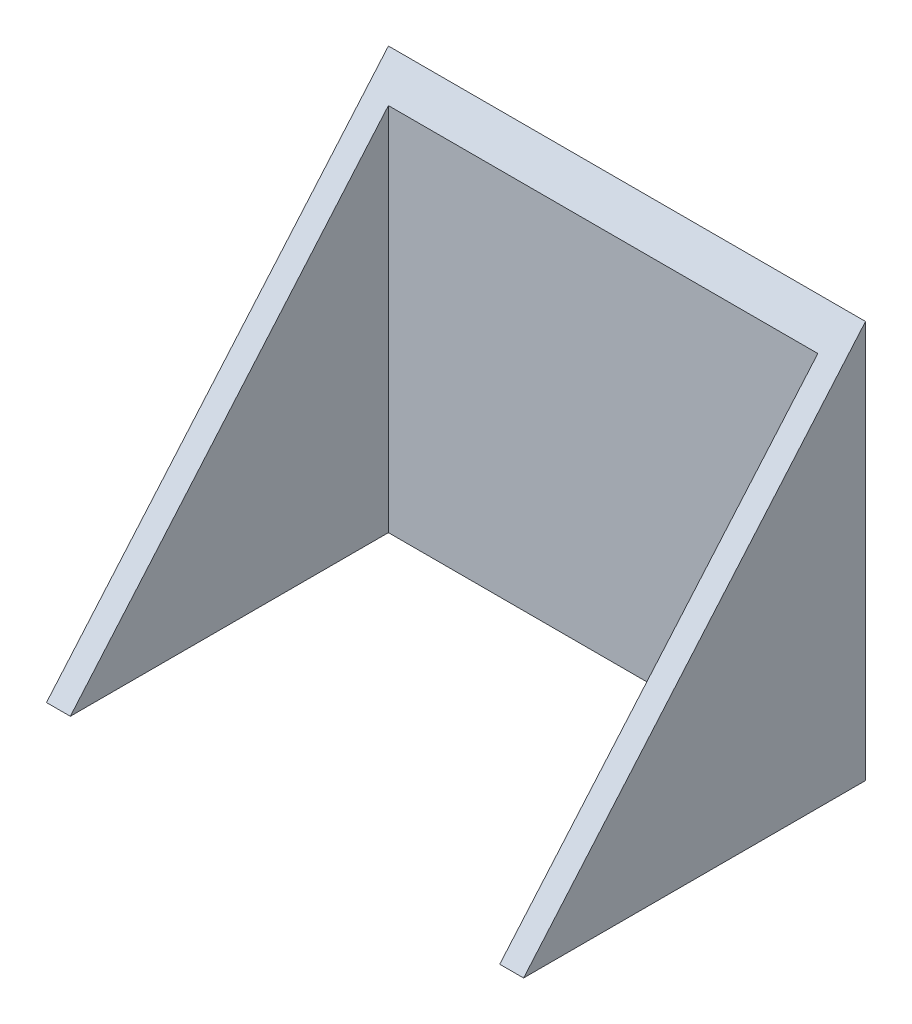
ISO-10303-21;
HEADER;
FILE_DESCRIPTION(('STEP AP214'),'2;1');
FILE_NAME('part.step','',(''),(''),'','','');
FILE_SCHEMA(('AUTOMOTIVE_DESIGN { 1 0 10303 214 1 1 1 1 }'));
ENDSEC;
DATA;
#1=APPLICATION_CONTEXT('core data for automotive mechanical design processes');
#2=APPLICATION_PROTOCOL_DEFINITION('international standard','automotive_design',2000,#1);
#3=PRODUCT_CONTEXT('',#1,'mechanical');
#4=PRODUCT('Part','Part','',(#3));
#5=PRODUCT_RELATED_PRODUCT_CATEGORY('part','',(#4));
#6=PRODUCT_DEFINITION_FORMATION('','',#4);
#7=PRODUCT_DEFINITION_CONTEXT('part definition',#1,'design');
#8=PRODUCT_DEFINITION('design','',#6,#7);
#9=PRODUCT_DEFINITION_SHAPE('','',#8);
#10=(LENGTH_UNIT() NAMED_UNIT(*) SI_UNIT(.MILLI.,.METRE.));
#11=(NAMED_UNIT(*) PLANE_ANGLE_UNIT() SI_UNIT($,.RADIAN.));
#12=(NAMED_UNIT(*) SI_UNIT($,.STERADIAN.) SOLID_ANGLE_UNIT());
#13=UNCERTAINTY_MEASURE_WITH_UNIT(LENGTH_MEASURE(1.E-05),#10,'distance_accuracy_value','');
#14=(GEOMETRIC_REPRESENTATION_CONTEXT(3) GLOBAL_UNCERTAINTY_ASSIGNED_CONTEXT((#13)) GLOBAL_UNIT_ASSIGNED_CONTEXT((#10,
#11,#12)) REPRESENTATION_CONTEXT('',''));
#15=CARTESIAN_POINT('',(0.,0.,0.));
#16=DIRECTION('',(0.,0.,1.));
#17=DIRECTION('',(1.,0.,0.));
#18=AXIS2_PLACEMENT_3D('',#15,#16,#17);
#19=CARTESIAN_POINT('',(60.0000000000002,100.,0.));
#20=DIRECTION('',(1.,0.,0.));
#21=DIRECTION('',(0.,0.,-1.));
#22=AXIS2_PLACEMENT_3D('',#19,#20,#21);
#23=PLANE('',#22);
#24=DIRECTION('',(0.,-0.758185196311683,0.652039268828047));
#25=VECTOR('',#24,1.);
#26=CARTESIAN_POINT('',(60.0000000000002,0.,83.));
#27=LINE('',#26,#25);
#28=CARTESIAN_POINT('',(60.0000000000002,100.,-3.00000000000001));
#29=VERTEX_POINT('',#28);
#30=CARTESIAN_POINT('',(60.0000000000002,0.,83.));
#31=VERTEX_POINT('',#30);
#32=EDGE_CURVE('E91',#29,#31,#27,.T.);
#33=ORIENTED_EDGE('',*,*,#32,.T.);
#34=DIRECTION('',(0.,0.,1.));
#35=VECTOR('',#34,1.);
#36=CARTESIAN_POINT('',(60.0000000000002,0.,0.));
#37=LINE('',#36,#35);
#38=CARTESIAN_POINT('',(60.0000000000002,0.,-3.00000000000001));
#39=VERTEX_POINT('',#38);
#40=EDGE_CURVE('E105',#39,#31,#37,.T.);
#41=ORIENTED_EDGE('',*,*,#40,.F.);
#42=DIRECTION('',(0.,-1.,0.));
#43=VECTOR('',#42,1.);
#44=CARTESIAN_POINT('',(60.0000000000002,100.,-3.00000000000001));
#45=LINE('',#44,#43);
#46=EDGE_CURVE('E11',#29,#39,#45,.T.);
#47=ORIENTED_EDGE('',*,*,#46,.F.);
#48=EDGE_LOOP('',(#33,#41,#47));
#49=FACE_BOUND('',#48,.T.);
#50=ADVANCED_FACE('F41',(#49),#23,.T.);
#51=CARTESIAN_POINT('',(0.,100.,-3.00000000000001));
#52=DIRECTION('',(0.,0.,-1.));
#53=DIRECTION('',(-1.,0.,0.));
#54=AXIS2_PLACEMENT_3D('',#51,#52,#53);
#55=PLANE('',#54);
#56=DIRECTION('',(1.,0.,0.));
#57=VECTOR('',#56,1.);
#58=CARTESIAN_POINT('',(0.,0.,-3.00000000000001));
#59=LINE('',#58,#57);
#60=CARTESIAN_POINT('',(-59.9999999999998,0.,-3.00000000000001));
#61=VERTEX_POINT('',#60);
#62=EDGE_CURVE('E125',#61,#39,#59,.T.);
#63=ORIENTED_EDGE('',*,*,#62,.F.);
#64=DIRECTION('',(0.,-1.,0.));
#65=VECTOR('',#64,1.);
#66=CARTESIAN_POINT('',(-59.9999999999998,100.,-3.00000000000001));
#67=LINE('',#66,#65);
#68=CARTESIAN_POINT('',(-59.9999999999998,100.,-3.00000000000001));
#69=VERTEX_POINT('',#68);
#70=EDGE_CURVE('E49',#69,#61,#67,.T.);
#71=ORIENTED_EDGE('',*,*,#70,.F.);
#72=DIRECTION('',(1.,0.,0.));
#73=VECTOR('',#72,1.);
#74=CARTESIAN_POINT('',(0.,100.,-3.00000000000001));
#75=LINE('',#74,#73);
#76=EDGE_CURVE('E95',#69,#29,#75,.T.);
#77=ORIENTED_EDGE('',*,*,#76,.T.);
#78=ORIENTED_EDGE('',*,*,#46,.T.);
#79=EDGE_LOOP('',(#63,#71,#77,#78));
#80=FACE_BOUND('',#79,.T.);
#81=ADVANCED_FACE('F110',(#80),#55,.T.);
#82=CARTESIAN_POINT('',(-59.9999999999998,100.,0.));
#83=DIRECTION('',(-1.,0.,0.));
#84=DIRECTION('',(0.,0.,1.));
#85=AXIS2_PLACEMENT_3D('',#82,#83,#84);
#86=PLANE('',#85);
#87=DIRECTION('',(0.,-0.758185196311683,0.652039268828047));
#88=VECTOR('',#87,1.);
#89=CARTESIAN_POINT('',(-59.9999999999998,0.,83.));
#90=LINE('',#89,#88);
#91=CARTESIAN_POINT('',(-59.9999999999998,0.,83.));
#92=VERTEX_POINT('',#91);
#93=EDGE_CURVE('E103',#69,#92,#90,.T.);
#94=ORIENTED_EDGE('',*,*,#93,.F.);
#95=ORIENTED_EDGE('',*,*,#70,.T.);
#96=DIRECTION('',(0.,0.,-1.));
#97=VECTOR('',#96,1.);
#98=CARTESIAN_POINT('',(-59.9999999999998,0.,0.));
#99=LINE('',#98,#97);
#100=EDGE_CURVE('E128',#92,#61,#99,.T.);
#101=ORIENTED_EDGE('',*,*,#100,.F.);
#102=EDGE_LOOP('',(#94,#95,#101));
#103=FACE_BOUND('',#102,.T.);
#104=ADVANCED_FACE('F148',(#103),#86,.T.);
#105=CARTESIAN_POINT('',(-53.9999999999998,100.,0.));
#106=DIRECTION('',(1.,0.,0.));
#107=DIRECTION('',(0.,0.,-1.));
#108=AXIS2_PLACEMENT_3D('',#105,#106,#107);
#109=PLANE('',#108);
#110=DIRECTION('',(0.,0.758185196311683,-0.652039268828047));
#111=VECTOR('',#110,1.);
#112=CARTESIAN_POINT('',(-53.9999999999998,98.5169004368821,-1.72453437571855));
#113=LINE('',#112,#111);
#114=CARTESIAN_POINT('',(-53.9999999999998,0.,83.));
#115=VERTEX_POINT('',#114);
#116=CARTESIAN_POINT('',(-53.9999999999998,93.0232558139535,2.99999999999999));
#117=VERTEX_POINT('',#116);
#118=EDGE_CURVE('E121',#115,#117,#113,.T.);
#119=ORIENTED_EDGE('',*,*,#118,.F.);
#120=DIRECTION('',(0.,0.,1.));
#121=VECTOR('',#120,1.);
#122=CARTESIAN_POINT('',(-53.9999999999998,0.,0.));
#123=LINE('',#122,#121);
#124=CARTESIAN_POINT('',(-53.9999999999998,0.,2.99999999999999));
#125=VERTEX_POINT('',#124);
#126=EDGE_CURVE('E135',#125,#115,#123,.T.);
#127=ORIENTED_EDGE('',*,*,#126,.F.);
#128=DIRECTION('',(0.,-1.,0.));
#129=VECTOR('',#128,1.);
#130=CARTESIAN_POINT('',(-53.9999999999998,100.,2.99999999999999));
#131=LINE('',#130,#129);
#132=EDGE_CURVE('E115',#117,#125,#131,.T.);
#133=ORIENTED_EDGE('',*,*,#132,.F.);
#134=EDGE_LOOP('',(#119,#127,#133));
#135=FACE_BOUND('',#134,.T.);
#136=ADVANCED_FACE('F158',(#135),#109,.T.);
#137=CARTESIAN_POINT('',(0.,100.,2.99999999999999));
#138=DIRECTION('',(0.,0.,-1.));
#139=DIRECTION('',(-1.,0.,0.));
#140=AXIS2_PLACEMENT_3D('',#137,#138,#139);
#141=PLANE('',#140);
#142=DIRECTION('',(0.,-1.,0.));
#143=VECTOR('',#142,1.);
#144=CARTESIAN_POINT('',(54.0000000000002,100.,2.99999999999999));
#145=LINE('',#144,#143);
#146=CARTESIAN_POINT('',(54.0000000000002,93.0232558139535,2.99999999999999));
#147=VERTEX_POINT('',#146);
#148=CARTESIAN_POINT('',(54.0000000000002,0.,2.99999999999999));
#149=VERTEX_POINT('',#148);
#150=EDGE_CURVE('E62',#147,#149,#145,.T.);
#151=ORIENTED_EDGE('',*,*,#150,.F.);
#152=DIRECTION('',(-1.,0.,0.));
#153=VECTOR('',#152,1.);
#154=CARTESIAN_POINT('',(0.,93.0232558139535,2.99999999999999));
#155=LINE('',#154,#153);
#156=EDGE_CURVE('E160',#147,#117,#155,.T.);
#157=ORIENTED_EDGE('',*,*,#156,.T.);
#158=ORIENTED_EDGE('',*,*,#132,.T.);
#159=DIRECTION('',(1.,0.,0.));
#160=VECTOR('',#159,1.);
#161=CARTESIAN_POINT('',(0.,0.,2.99999999999999));
#162=LINE('',#161,#160);
#163=EDGE_CURVE('E139',#125,#149,#162,.T.);
#164=ORIENTED_EDGE('',*,*,#163,.T.);
#165=EDGE_LOOP('',(#151,#157,#158,#164));
#166=FACE_BOUND('',#165,.T.);
#167=ADVANCED_FACE('F169',(#166),#141,.F.);
#168=CARTESIAN_POINT('',(54.0000000000002,100.,0.));
#169=DIRECTION('',(1.,0.,0.));
#170=DIRECTION('',(0.,0.,-1.));
#171=AXIS2_PLACEMENT_3D('',#168,#169,#170);
#172=PLANE('',#171);
#173=DIRECTION('',(0.,0.,1.));
#174=VECTOR('',#173,1.);
#175=CARTESIAN_POINT('',(54.0000000000002,0.,0.));
#176=LINE('',#175,#174);
#177=CARTESIAN_POINT('',(54.0000000000002,0.,83.));
#178=VERTEX_POINT('',#177);
#179=EDGE_CURVE('E117',#149,#178,#176,.T.);
#180=ORIENTED_EDGE('',*,*,#179,.T.);
#181=DIRECTION('',(0.,0.758185196311683,-0.652039268828047));
#182=VECTOR('',#181,1.);
#183=CARTESIAN_POINT('',(54.0000000000002,98.5169004368821,-1.72453437571855));
#184=LINE('',#183,#182);
#185=EDGE_CURVE('E56',#178,#147,#184,.T.);
#186=ORIENTED_EDGE('',*,*,#185,.T.);
#187=ORIENTED_EDGE('',*,*,#150,.T.);
#188=EDGE_LOOP('',(#180,#186,#187));
#189=FACE_BOUND('',#188,.T.);
#190=ADVANCED_FACE('F167',(#189),#172,.F.);
#191=CARTESIAN_POINT('',(0.,0.,0.));
#192=DIRECTION('',(0.,1.,0.));
#193=DIRECTION('',(0.,0.,1.));
#194=AXIS2_PLACEMENT_3D('',#191,#192,#193);
#195=PLANE('',#194);
#196=ORIENTED_EDGE('',*,*,#40,.T.);
#197=DIRECTION('',(-1.,0.,0.));
#198=VECTOR('',#197,1.);
#199=CARTESIAN_POINT('',(0.,0.,83.));
#200=LINE('',#199,#198);
#201=EDGE_CURVE('E98',#31,#178,#200,.T.);
#202=ORIENTED_EDGE('',*,*,#201,.T.);
#203=ORIENTED_EDGE('',*,*,#179,.F.);
#204=ORIENTED_EDGE('',*,*,#163,.F.);
#205=ORIENTED_EDGE('',*,*,#126,.T.);
#206=DIRECTION('',(1.,0.,0.));
#207=VECTOR('',#206,1.);
#208=CARTESIAN_POINT('',(0.,0.,83.));
#209=LINE('',#208,#207);
#210=EDGE_CURVE('E132',#92,#115,#209,.T.);
#211=ORIENTED_EDGE('',*,*,#210,.F.);
#212=ORIENTED_EDGE('',*,*,#100,.T.);
#213=ORIENTED_EDGE('',*,*,#62,.T.);
#214=EDGE_LOOP('',(#196,#202,#203,#204,#205,#211,#212,#213));
#215=FACE_BOUND('',#214,.T.);
#216=ADVANCED_FACE('F151',(#215),#195,.F.);
#217=CARTESIAN_POINT('',(191.893896750381,0.,83.));
#218=DIRECTION('',(0.,-0.652039268828047,-0.758185196311683));
#219=DIRECTION('',(0.,0.758185196311683,-0.652039268828047));
#220=AXIS2_PLACEMENT_3D('',#217,#218,#219);
#221=PLANE('',#220);
#222=ORIENTED_EDGE('',*,*,#118,.T.);
#223=ORIENTED_EDGE('',*,*,#156,.F.);
#224=ORIENTED_EDGE('',*,*,#185,.F.);
#225=ORIENTED_EDGE('',*,*,#201,.F.);
#226=ORIENTED_EDGE('',*,*,#32,.F.);
#227=ORIENTED_EDGE('',*,*,#76,.F.);
#228=ORIENTED_EDGE('',*,*,#93,.T.);
#229=ORIENTED_EDGE('',*,*,#210,.T.);
#230=EDGE_LOOP('',(#222,#223,#224,#225,#226,#227,#228,#229));
#231=FACE_BOUND('',#230,.T.);
#232=ADVANCED_FACE('F93',(#231),#221,.F.);
#233=CLOSED_SHELL('',(#50,#81,#104,#136,#167,#190,#216,#232));
#234=MANIFOLD_SOLID_BREP('B2',#233);
#235=ADVANCED_BREP_SHAPE_REPRESENTATION('',(#18,#234),#14);
#236=SHAPE_DEFINITION_REPRESENTATION(#9,#235);
ENDSEC;
END-ISO-10303-21;
